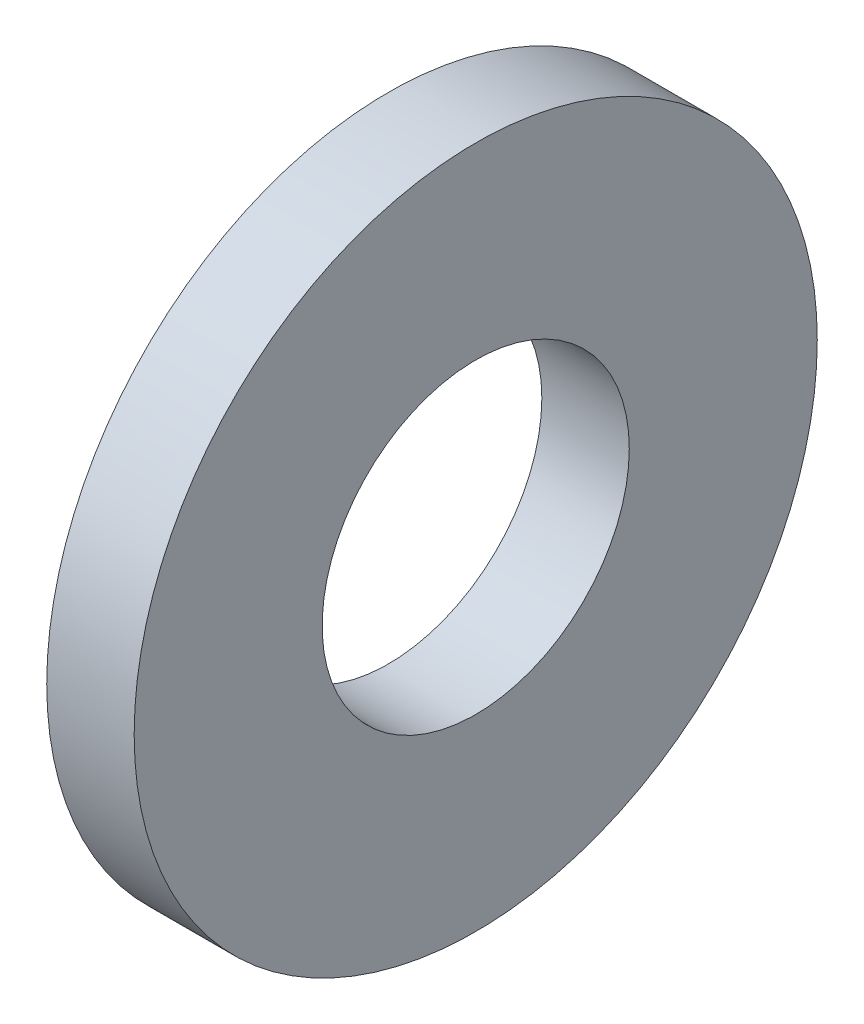
ISO-10303-21;
HEADER;
FILE_DESCRIPTION(('STEP AP214'),'2;1');
FILE_NAME('part.step','',(''),(''),'','','');
FILE_SCHEMA(('AUTOMOTIVE_DESIGN { 1 0 10303 214 1 1 1 1 }'));
ENDSEC;
DATA;
#1=APPLICATION_CONTEXT('core data for automotive mechanical design processes');
#2=APPLICATION_PROTOCOL_DEFINITION('international standard','automotive_design',2000,#1);
#3=PRODUCT_CONTEXT('',#1,'mechanical');
#4=PRODUCT('Part','Part','',(#3));
#5=PRODUCT_RELATED_PRODUCT_CATEGORY('part','',(#4));
#6=PRODUCT_DEFINITION_FORMATION('','',#4);
#7=PRODUCT_DEFINITION_CONTEXT('part definition',#1,'design');
#8=PRODUCT_DEFINITION('design','',#6,#7);
#9=PRODUCT_DEFINITION_SHAPE('','',#8);
#10=(LENGTH_UNIT() NAMED_UNIT(*) SI_UNIT(.MILLI.,.METRE.));
#11=(NAMED_UNIT(*) PLANE_ANGLE_UNIT() SI_UNIT($,.RADIAN.));
#12=(NAMED_UNIT(*) SI_UNIT($,.STERADIAN.) SOLID_ANGLE_UNIT());
#13=UNCERTAINTY_MEASURE_WITH_UNIT(LENGTH_MEASURE(1.E-05),#10,'distance_accuracy_value','');
#14=(GEOMETRIC_REPRESENTATION_CONTEXT(3) GLOBAL_UNCERTAINTY_ASSIGNED_CONTEXT((#13)) GLOBAL_UNIT_ASSIGNED_CONTEXT((#10,
#11,#12)) REPRESENTATION_CONTEXT('',''));
#15=CARTESIAN_POINT('',(0.,0.,0.));
#16=DIRECTION('',(0.,0.,1.));
#17=DIRECTION('',(1.,0.,0.));
#18=AXIS2_PLACEMENT_3D('',#15,#16,#17);
#19=CARTESIAN_POINT('',(2.032,0.,0.));
#20=DIRECTION('',(1.,0.,0.));
#21=DIRECTION('',(0.,0.,-1.));
#22=AXIS2_PLACEMENT_3D('',#19,#20,#21);
#23=PLANE('',#22);
#24=CARTESIAN_POINT('',(2.032,0.,0.));
#25=DIRECTION('',(1.,0.,0.));
#26=DIRECTION('',(0.,0.,-1.));
#27=AXIS2_PLACEMENT_3D('',#24,#25,#26);
#28=CIRCLE('',#27,7.9375);
#29=CARTESIAN_POINT('',(2.032,0.,-7.9375));
#30=VERTEX_POINT('',#29);
#31=EDGE_CURVE('E10',#30,#30,#28,.T.);
#32=ORIENTED_EDGE('',*,*,#31,.T.);
#33=EDGE_LOOP('',(#32));
#34=FACE_BOUND('',#33,.T.);
#35=CARTESIAN_POINT('',(2.032,0.,0.));
#36=DIRECTION('',(1.,0.,0.));
#37=DIRECTION('',(0.,0.,-1.));
#38=AXIS2_PLACEMENT_3D('',#35,#36,#37);
#39=CIRCLE('',#38,3.5687);
#40=CARTESIAN_POINT('',(2.032,0.,-3.5687));
#41=VERTEX_POINT('',#40);
#42=EDGE_CURVE('E43',#41,#41,#39,.T.);
#43=ORIENTED_EDGE('',*,*,#42,.F.);
#44=EDGE_LOOP('',(#43));
#45=FACE_BOUND('',#44,.T.);
#46=ADVANCED_FACE('F32',(#34,#45),#23,.T.);
#47=CARTESIAN_POINT('',(0.,0.,0.));
#48=DIRECTION('',(1.,0.,0.));
#49=DIRECTION('',(0.,0.,-1.));
#50=AXIS2_PLACEMENT_3D('',#47,#48,#49);
#51=PLANE('',#50);
#52=CARTESIAN_POINT('',(0.,0.,0.));
#53=DIRECTION('',(1.,0.,0.));
#54=DIRECTION('',(0.,0.,-1.));
#55=AXIS2_PLACEMENT_3D('',#52,#53,#54);
#56=CIRCLE('',#55,7.9375);
#57=CARTESIAN_POINT('',(0.,0.,-7.9375));
#58=VERTEX_POINT('',#57);
#59=EDGE_CURVE('E36',#58,#58,#56,.T.);
#60=ORIENTED_EDGE('',*,*,#59,.F.);
#61=EDGE_LOOP('',(#60));
#62=FACE_BOUND('',#61,.T.);
#63=CARTESIAN_POINT('',(0.,0.,0.));
#64=DIRECTION('',(1.,0.,0.));
#65=DIRECTION('',(0.,0.,-1.));
#66=AXIS2_PLACEMENT_3D('',#63,#64,#65);
#67=CIRCLE('',#66,3.5687);
#68=CARTESIAN_POINT('',(0.,0.,-3.5687));
#69=VERTEX_POINT('',#68);
#70=EDGE_CURVE('E45',#69,#69,#67,.T.);
#71=ORIENTED_EDGE('',*,*,#70,.T.);
#72=EDGE_LOOP('',(#71));
#73=FACE_BOUND('',#72,.T.);
#74=ADVANCED_FACE('F55',(#62,#73),#51,.F.);
#75=CARTESIAN_POINT('',(2.032,0.,0.));
#76=DIRECTION('',(-1.,0.,0.));
#77=DIRECTION('',(0.,0.,1.));
#78=AXIS2_PLACEMENT_3D('',#75,#76,#77);
#79=CYLINDRICAL_SURFACE('',#78,7.9375);
#80=ORIENTED_EDGE('',*,*,#31,.F.);
#81=EDGE_LOOP('',(#80));
#82=FACE_BOUND('',#81,.T.);
#83=ORIENTED_EDGE('',*,*,#59,.T.);
#84=EDGE_LOOP('',(#83));
#85=FACE_BOUND('',#84,.T.);
#86=ADVANCED_FACE('F34',(#82,#85),#79,.T.);
#87=CARTESIAN_POINT('',(2.032,0.,0.));
#88=DIRECTION('',(-1.,0.,0.));
#89=DIRECTION('',(0.,0.,1.));
#90=AXIS2_PLACEMENT_3D('',#87,#88,#89);
#91=CYLINDRICAL_SURFACE('',#90,3.5687);
#92=ORIENTED_EDGE('',*,*,#42,.T.);
#93=EDGE_LOOP('',(#92));
#94=FACE_BOUND('',#93,.T.);
#95=ORIENTED_EDGE('',*,*,#70,.F.);
#96=EDGE_LOOP('',(#95));
#97=FACE_BOUND('',#96,.T.);
#98=ADVANCED_FACE('F51',(#94,#97),#91,.F.);
#99=CLOSED_SHELL('',(#46,#74,#86,#98));
#100=MANIFOLD_SOLID_BREP('B2',#99);
#101=ADVANCED_BREP_SHAPE_REPRESENTATION('',(#18,#100),#14);
#102=SHAPE_DEFINITION_REPRESENTATION(#9,#101);
ENDSEC;
END-ISO-10303-21;
